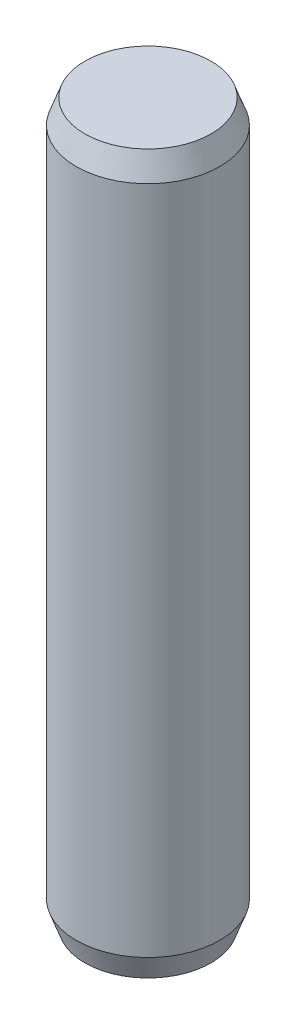
ISO-10303-21;
HEADER;
FILE_DESCRIPTION(('STEP AP214'),'2;1');
FILE_NAME('part.step','',(''),(''),'','','');
FILE_SCHEMA(('AUTOMOTIVE_DESIGN { 1 0 10303 214 1 1 1 1 }'));
ENDSEC;
DATA;
#1=APPLICATION_CONTEXT('core data for automotive mechanical design processes');
#2=APPLICATION_PROTOCOL_DEFINITION('international standard','automotive_design',2000,#1);
#3=PRODUCT_CONTEXT('',#1,'mechanical');
#4=PRODUCT('Part','Part','',(#3));
#5=PRODUCT_RELATED_PRODUCT_CATEGORY('part','',(#4));
#6=PRODUCT_DEFINITION_FORMATION('','',#4);
#7=PRODUCT_DEFINITION_CONTEXT('part definition',#1,'design');
#8=PRODUCT_DEFINITION('design','',#6,#7);
#9=PRODUCT_DEFINITION_SHAPE('','',#8);
#10=(LENGTH_UNIT() NAMED_UNIT(*) SI_UNIT(.MILLI.,.METRE.));
#11=(NAMED_UNIT(*) PLANE_ANGLE_UNIT() SI_UNIT($,.RADIAN.));
#12=(NAMED_UNIT(*) SI_UNIT($,.STERADIAN.) SOLID_ANGLE_UNIT());
#13=UNCERTAINTY_MEASURE_WITH_UNIT(LENGTH_MEASURE(1.E-05),#10,'distance_accuracy_value','');
#14=(GEOMETRIC_REPRESENTATION_CONTEXT(3) GLOBAL_UNCERTAINTY_ASSIGNED_CONTEXT((#13)) GLOBAL_UNIT_ASSIGNED_CONTEXT((#10,
#11,#12)) REPRESENTATION_CONTEXT('',''));
#15=CARTESIAN_POINT('',(0.,0.,0.));
#16=DIRECTION('',(0.,0.,1.));
#17=DIRECTION('',(1.,0.,0.));
#18=AXIS2_PLACEMENT_3D('',#15,#16,#17);
#19=CARTESIAN_POINT('',(0.,30.,0.));
#20=DIRECTION('',(0.,-1.,0.));
#21=DIRECTION('',(0.,0.,-1.));
#22=AXIS2_PLACEMENT_3D('',#19,#20,#21);
#23=CYLINDRICAL_SURFACE('',#22,3.);
#24=CARTESIAN_POINT('',(0.,1.00000000000001,0.));
#25=DIRECTION('',(0.,1.,0.));
#26=DIRECTION('',(0.,0.,1.));
#27=AXIS2_PLACEMENT_3D('',#24,#25,#26);
#28=CIRCLE('',#27,3.);
#29=CARTESIAN_POINT('',(0.,1.00000000000001,3.));
#30=VERTEX_POINT('',#29);
#31=EDGE_CURVE('E43',#30,#30,#28,.T.);
#32=ORIENTED_EDGE('',*,*,#31,.T.);
#33=EDGE_LOOP('',(#32));
#34=FACE_BOUND('',#33,.T.);
#35=CARTESIAN_POINT('',(0.,29.,0.));
#36=DIRECTION('',(0.,1.,0.));
#37=DIRECTION('',(0.,0.,1.));
#38=AXIS2_PLACEMENT_3D('',#35,#36,#37);
#39=CIRCLE('',#38,3.);
#40=CARTESIAN_POINT('',(0.,29.,3.));
#41=VERTEX_POINT('',#40);
#42=EDGE_CURVE('E47',#41,#41,#39,.F.);
#43=ORIENTED_EDGE('',*,*,#42,.T.);
#44=EDGE_LOOP('',(#43));
#45=FACE_BOUND('',#44,.T.);
#46=ADVANCED_FACE('F36',(#34,#45),#23,.T.);
#47=CARTESIAN_POINT('',(0.,30.,0.));
#48=DIRECTION('',(0.,1.,0.));
#49=DIRECTION('',(0.,0.,1.));
#50=AXIS2_PLACEMENT_3D('',#47,#48,#49);
#51=PLANE('',#50);
#52=CARTESIAN_POINT('',(0.,30.,0.));
#53=DIRECTION('',(0.,1.,0.));
#54=DIRECTION('',(0.,0.,1.));
#55=AXIS2_PLACEMENT_3D('',#52,#53,#54);
#56=CIRCLE('',#55,2.63602976573379);
#57=CARTESIAN_POINT('',(0.,30.,2.63602976573379));
#58=VERTEX_POINT('',#57);
#59=EDGE_CURVE('E51',#58,#58,#56,.T.);
#60=ORIENTED_EDGE('',*,*,#59,.T.);
#61=EDGE_LOOP('',(#60));
#62=FACE_BOUND('',#61,.T.);
#63=ADVANCED_FACE('F57',(#62),#51,.T.);
#64=CARTESIAN_POINT('',(0.,0.,0.));
#65=DIRECTION('',(0.,1.,0.));
#66=DIRECTION('',(0.,0.,1.));
#67=AXIS2_PLACEMENT_3D('',#64,#65,#66);
#68=PLANE('',#67);
#69=CARTESIAN_POINT('',(0.,0.,0.));
#70=DIRECTION('',(0.,1.,0.));
#71=DIRECTION('',(0.,0.,1.));
#72=AXIS2_PLACEMENT_3D('',#69,#70,#71);
#73=CIRCLE('',#72,2.6360297657338);
#74=CARTESIAN_POINT('',(0.,0.,2.6360297657338));
#75=VERTEX_POINT('',#74);
#76=EDGE_CURVE('E10',#75,#75,#73,.F.);
#77=ORIENTED_EDGE('',*,*,#76,.T.);
#78=EDGE_LOOP('',(#77));
#79=FACE_BOUND('',#78,.T.);
#80=ADVANCED_FACE('F61',(#79),#68,.F.);
#81=CARTESIAN_POINT('',(0.,30.,0.));
#82=DIRECTION('',(0.,-1.,0.));
#83=DIRECTION('',(0.,0.,-1.));
#84=AXIS2_PLACEMENT_3D('',#81,#82,#83);
#85=CONICAL_SURFACE('',#84,2.63602976573379,0.349065850398862);
#86=ORIENTED_EDGE('',*,*,#42,.F.);
#87=EDGE_LOOP('',(#86));
#88=FACE_BOUND('',#87,.T.);
#89=ORIENTED_EDGE('',*,*,#59,.F.);
#90=EDGE_LOOP('',(#89));
#91=FACE_BOUND('',#90,.T.);
#92=ADVANCED_FACE('F59',(#88,#91),#85,.T.);
#93=CARTESIAN_POINT('',(0.,1.00000000000001,0.));
#94=DIRECTION('',(0.,1.,0.));
#95=DIRECTION('',(0.,0.,1.));
#96=AXIS2_PLACEMENT_3D('',#93,#94,#95);
#97=CONICAL_SURFACE('',#96,3.,0.349065850398863);
#98=ORIENTED_EDGE('',*,*,#76,.F.);
#99=EDGE_LOOP('',(#98));
#100=FACE_BOUND('',#99,.T.);
#101=ORIENTED_EDGE('',*,*,#31,.F.);
#102=EDGE_LOOP('',(#101));
#103=FACE_BOUND('',#102,.T.);
#104=ADVANCED_FACE('F38',(#100,#103),#97,.T.);
#105=CLOSED_SHELL('',(#46,#63,#80,#92,#104));
#106=MANIFOLD_SOLID_BREP('B2',#105);
#107=ADVANCED_BREP_SHAPE_REPRESENTATION('',(#18,#106),#14);
#108=SHAPE_DEFINITION_REPRESENTATION(#9,#107);
ENDSEC;
END-ISO-10303-21;
